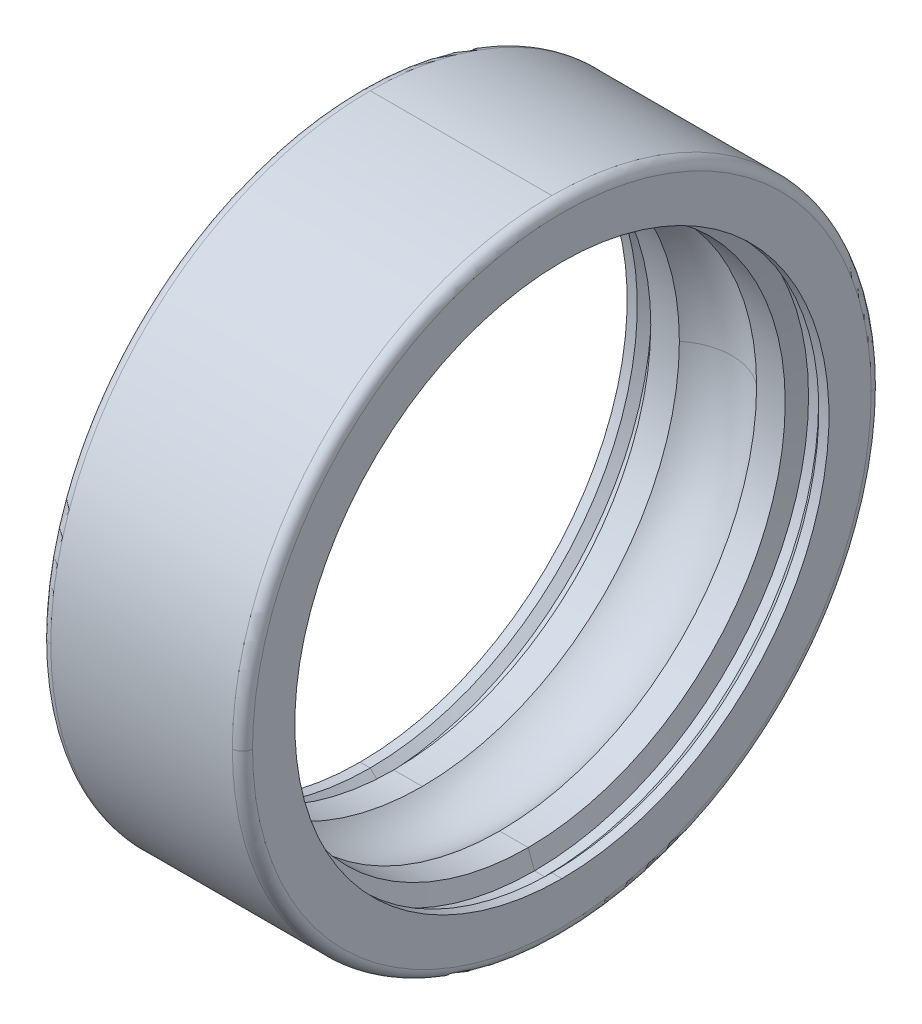
ISO-10303-21;
HEADER;
FILE_DESCRIPTION(('STEP AP214'),'2;1');
FILE_NAME('part.step','',(''),(''),'','','');
FILE_SCHEMA(('AUTOMOTIVE_DESIGN { 1 0 10303 214 1 1 1 1 }'));
ENDSEC;
DATA;
#1=APPLICATION_CONTEXT('core data for automotive mechanical design processes');
#2=APPLICATION_PROTOCOL_DEFINITION('international standard','automotive_design',2000,#1);
#3=PRODUCT_CONTEXT('',#1,'mechanical');
#4=PRODUCT('Part','Part','',(#3));
#5=PRODUCT_RELATED_PRODUCT_CATEGORY('part','',(#4));
#6=PRODUCT_DEFINITION_FORMATION('','',#4);
#7=PRODUCT_DEFINITION_CONTEXT('part definition',#1,'design');
#8=PRODUCT_DEFINITION('design','',#6,#7);
#9=PRODUCT_DEFINITION_SHAPE('','',#8);
#10=(LENGTH_UNIT() NAMED_UNIT(*) SI_UNIT(.MILLI.,.METRE.));
#11=(NAMED_UNIT(*) PLANE_ANGLE_UNIT() SI_UNIT($,.RADIAN.));
#12=(NAMED_UNIT(*) SI_UNIT($,.STERADIAN.) SOLID_ANGLE_UNIT());
#13=UNCERTAINTY_MEASURE_WITH_UNIT(LENGTH_MEASURE(1.E-05),#10,'distance_accuracy_value','');
#14=(GEOMETRIC_REPRESENTATION_CONTEXT(3) GLOBAL_UNCERTAINTY_ASSIGNED_CONTEXT((#13)) GLOBAL_UNIT_ASSIGNED_CONTEXT((#10,
#11,#12)) REPRESENTATION_CONTEXT('',''));
#15=CARTESIAN_POINT('',(0.,0.,0.));
#16=DIRECTION('',(0.,0.,1.));
#17=DIRECTION('',(1.,0.,0.));
#18=AXIS2_PLACEMENT_3D('',#15,#16,#17);
#19=CARTESIAN_POINT('',(0.,0.,0.));
#20=DIRECTION('',(1.,0.,0.));
#21=DIRECTION('',(0.,1.,0.));
#22=AXIS2_PLACEMENT_3D('',#19,#20,#21);
#23=CYLINDRICAL_SURFACE('',#22,9.5);
#24=DIRECTION('',(1.,0.,0.));
#25=VECTOR('',#24,1.);
#26=CARTESIAN_POINT('',(0.,-9.5,0.));
#27=LINE('',#26,#25);
#28=CARTESIAN_POINT('',(-2.7,-9.5,0.));
#29=VERTEX_POINT('',#28);
#30=CARTESIAN_POINT('',(2.7,-9.5,0.));
#31=VERTEX_POINT('',#30);
#32=EDGE_CURVE('E265',#29,#31,#27,.T.);
#33=ORIENTED_EDGE('',*,*,#32,.F.);
#34=CARTESIAN_POINT('',(-2.7,0.,0.));
#35=DIRECTION('',(1.,0.,0.));
#36=DIRECTION('',(0.,0.,-1.));
#37=AXIS2_PLACEMENT_3D('',#34,#35,#36);
#38=CIRCLE('',#37,9.5);
#39=CARTESIAN_POINT('',(-2.7,0.,-9.5));
#40=VERTEX_POINT('',#39);
#41=EDGE_CURVE('E42',#29,#40,#38,.T.);
#42=ORIENTED_EDGE('',*,*,#41,.T.);
#43=CARTESIAN_POINT('',(-2.7,0.,0.));
#44=DIRECTION('',(1.,0.,0.));
#45=DIRECTION('',(0.,0.,-1.));
#46=AXIS2_PLACEMENT_3D('',#43,#44,#45);
#47=CIRCLE('',#46,9.5);
#48=CARTESIAN_POINT('',(-2.7,9.5,0.));
#49=VERTEX_POINT('',#48);
#50=EDGE_CURVE('E249',#40,#49,#47,.T.);
#51=ORIENTED_EDGE('',*,*,#50,.T.);
#52=DIRECTION('',(1.,0.,0.));
#53=VECTOR('',#52,1.);
#54=CARTESIAN_POINT('',(0.,9.5,0.));
#55=LINE('',#54,#53);
#56=CARTESIAN_POINT('',(2.7,9.5,0.));
#57=VERTEX_POINT('',#56);
#58=EDGE_CURVE('E287',#49,#57,#55,.T.);
#59=ORIENTED_EDGE('',*,*,#58,.T.);
#60=CARTESIAN_POINT('',(2.7,0.,0.));
#61=DIRECTION('',(1.,0.,0.));
#62=DIRECTION('',(0.,0.,-1.));
#63=AXIS2_PLACEMENT_3D('',#60,#61,#62);
#64=CIRCLE('',#63,9.5);
#65=CARTESIAN_POINT('',(2.7,0.,-9.5));
#66=VERTEX_POINT('',#65);
#67=EDGE_CURVE('E300',#66,#57,#64,.T.);
#68=ORIENTED_EDGE('',*,*,#67,.F.);
#69=CARTESIAN_POINT('',(2.7,0.,0.));
#70=DIRECTION('',(1.,0.,0.));
#71=DIRECTION('',(0.,0.,-1.));
#72=AXIS2_PLACEMENT_3D('',#69,#70,#71);
#73=CIRCLE('',#72,9.5);
#74=EDGE_CURVE('E11',#31,#66,#73,.T.);
#75=ORIENTED_EDGE('',*,*,#74,.F.);
#76=EDGE_LOOP('',(#33,#42,#51,#59,#68,#75));
#77=FACE_BOUND('',#76,.T.);
#78=ADVANCED_FACE('F16',(#77),#23,.T.);
#79=CARTESIAN_POINT('',(2.7,0.,0.));
#80=DIRECTION('',(1.,0.,0.));
#81=DIRECTION('',(0.,0.,-1.));
#82=AXIS2_PLACEMENT_3D('',#79,#80,#81);
#83=TOROIDAL_SURFACE('',#82,9.2,0.3);
#84=CARTESIAN_POINT('',(2.7,0.,9.2));
#85=DIRECTION('',(0.,1.,0.));
#86=DIRECTION('',(0.,0.,1.));
#87=AXIS2_PLACEMENT_3D('',#84,#85,#86);
#88=CIRCLE('',#87,0.3);
#89=CARTESIAN_POINT('',(2.7,0.,9.5));
#90=VERTEX_POINT('',#89);
#91=CARTESIAN_POINT('',(3.,0.,9.2));
#92=VERTEX_POINT('',#91);
#93=EDGE_CURVE('E295',#90,#92,#88,.T.);
#94=ORIENTED_EDGE('',*,*,#93,.F.);
#95=CARTESIAN_POINT('',(2.7,0.,0.));
#96=DIRECTION('',(1.,0.,0.));
#97=DIRECTION('',(0.,0.,-1.));
#98=AXIS2_PLACEMENT_3D('',#95,#96,#97);
#99=CIRCLE('',#98,9.5);
#100=EDGE_CURVE('E261',#90,#31,#99,.T.);
#101=ORIENTED_EDGE('',*,*,#100,.T.);
#102=ORIENTED_EDGE('',*,*,#74,.T.);
#103=CARTESIAN_POINT('',(2.7,0.,-9.2));
#104=DIRECTION('',(0.,-1.,0.));
#105=DIRECTION('',(0.,0.,-1.));
#106=AXIS2_PLACEMENT_3D('',#103,#104,#105);
#107=CIRCLE('',#106,0.3);
#108=CARTESIAN_POINT('',(3.,0.,-9.2));
#109=VERTEX_POINT('',#108);
#110=EDGE_CURVE('E333',#66,#109,#107,.T.);
#111=ORIENTED_EDGE('',*,*,#110,.T.);
#112=CARTESIAN_POINT('',(3.,0.,0.));
#113=DIRECTION('',(1.,0.,0.));
#114=DIRECTION('',(0.,0.,-1.));
#115=AXIS2_PLACEMENT_3D('',#112,#113,#114);
#116=CIRCLE('',#115,9.2);
#117=EDGE_CURVE('E27',#92,#109,#116,.T.);
#118=ORIENTED_EDGE('',*,*,#117,.F.);
#119=EDGE_LOOP('',(#94,#101,#102,#111,#118));
#120=FACE_BOUND('',#119,.T.);
#121=ADVANCED_FACE('F774',(#120),#83,.T.);
#122=CARTESIAN_POINT('',(3.,7.94285714285714,0.));
#123=DIRECTION('',(1.,0.,0.));
#124=DIRECTION('',(0.,1.,0.));
#125=AXIS2_PLACEMENT_3D('',#122,#123,#124);
#126=PLANE('',#125);
#127=CARTESIAN_POINT('',(3.,0.,0.));
#128=DIRECTION('',(1.,0.,0.));
#129=DIRECTION('',(0.,0.,-1.));
#130=AXIS2_PLACEMENT_3D('',#127,#128,#129);
#131=CIRCLE('',#130,7.94285714285714);
#132=CARTESIAN_POINT('',(3.,7.94285714285714,0.));
#133=VERTEX_POINT('',#132);
#134=CARTESIAN_POINT('',(3.,-7.94285714285714,0.));
#135=VERTEX_POINT('',#134);
#136=EDGE_CURVE('E444',#133,#135,#131,.T.);
#137=ORIENTED_EDGE('',*,*,#136,.F.);
#138=CARTESIAN_POINT('',(3.,0.,0.));
#139=DIRECTION('',(1.,0.,0.));
#140=DIRECTION('',(0.,0.,-1.));
#141=AXIS2_PLACEMENT_3D('',#138,#139,#140);
#142=CIRCLE('',#141,7.94285714285714);
#143=EDGE_CURVE('E338',#135,#133,#142,.T.);
#144=ORIENTED_EDGE('',*,*,#143,.F.);
#145=EDGE_LOOP('',(#137,#144));
#146=FACE_BOUND('',#145,.T.);
#147=CARTESIAN_POINT('',(3.,0.,0.));
#148=DIRECTION('',(1.,0.,0.));
#149=DIRECTION('',(0.,0.,-1.));
#150=AXIS2_PLACEMENT_3D('',#147,#148,#149);
#151=CIRCLE('',#150,9.2);
#152=EDGE_CURVE('E299',#109,#92,#151,.T.);
#153=ORIENTED_EDGE('',*,*,#152,.T.);
#154=ORIENTED_EDGE('',*,*,#117,.T.);
#155=EDGE_LOOP('',(#153,#154));
#156=FACE_BOUND('',#155,.T.);
#157=ADVANCED_FACE('F473',(#146,#156),#126,.T.);
#158=CARTESIAN_POINT('',(2.85,0.,0.));
#159=DIRECTION('',(1.,0.,0.));
#160=DIRECTION('',(0.,1.,0.));
#161=AXIS2_PLACEMENT_3D('',#158,#159,#160);
#162=CYLINDRICAL_SURFACE('',#161,7.94285714285714);
#163=DIRECTION('',(1.,0.,0.));
#164=VECTOR('',#163,1.);
#165=CARTESIAN_POINT('',(2.85,-7.94285714285714,0.));
#166=LINE('',#165,#164);
#167=CARTESIAN_POINT('',(2.7,-7.94285714285714,0.));
#168=VERTEX_POINT('',#167);
#169=EDGE_CURVE('E343',#168,#135,#166,.T.);
#170=ORIENTED_EDGE('',*,*,#169,.F.);
#171=CARTESIAN_POINT('',(2.7,0.,0.));
#172=DIRECTION('',(1.,0.,0.));
#173=DIRECTION('',(0.,0.,-1.));
#174=AXIS2_PLACEMENT_3D('',#171,#172,#173);
#175=CIRCLE('',#174,7.94285714285714);
#176=CARTESIAN_POINT('',(2.7,7.94285714285714,0.));
#177=VERTEX_POINT('',#176);
#178=EDGE_CURVE('E371',#177,#168,#175,.T.);
#179=ORIENTED_EDGE('',*,*,#178,.F.);
#180=DIRECTION('',(1.,0.,0.));
#181=VECTOR('',#180,1.);
#182=CARTESIAN_POINT('',(2.85,7.94285714285714,0.));
#183=LINE('',#182,#181);
#184=EDGE_CURVE('E342',#177,#133,#183,.T.);
#185=ORIENTED_EDGE('',*,*,#184,.T.);
#186=ORIENTED_EDGE('',*,*,#136,.T.);
#187=EDGE_LOOP('',(#170,#179,#185,#186));
#188=FACE_BOUND('',#187,.T.);
#189=ADVANCED_FACE('F466',(#188),#162,.F.);
#190=CARTESIAN_POINT('',(2.5920990299492,0.,0.));
#191=DIRECTION('',(-1.,0.,0.));
#192=DIRECTION('',(0.,1.,0.));
#193=AXIS2_PLACEMENT_3D('',#190,#191,#192);
#194=CONICAL_SURFACE('',#193,8.04705589842599,0.767944870877518);
#195=DIRECTION('',(-0.719339800338642,-0.694658370459007,0.));
#196=VECTOR('',#195,1.);
#197=CARTESIAN_POINT('',(2.5920990299492,-8.04705589842599,0.));
#198=LINE('',#197,#196);
#199=CARTESIAN_POINT('',(2.48419805989841,-8.15125465399484,0.));
#200=VERTEX_POINT('',#199);
#201=EDGE_CURVE('E260',#168,#200,#198,.T.);
#202=ORIENTED_EDGE('',*,*,#201,.F.);
#203=CARTESIAN_POINT('',(2.7,0.,0.));
#204=DIRECTION('',(1.,0.,0.));
#205=DIRECTION('',(0.,0.,-1.));
#206=AXIS2_PLACEMENT_3D('',#203,#204,#205);
#207=CIRCLE('',#206,7.94285714285714);
#208=EDGE_CURVE('E337',#168,#177,#207,.T.);
#209=ORIENTED_EDGE('',*,*,#208,.T.);
#210=DIRECTION('',(-0.719339800338642,0.694658370459007,0.));
#211=VECTOR('',#210,1.);
#212=CARTESIAN_POINT('',(2.5920990299492,8.04705589842599,0.));
#213=LINE('',#212,#211);
#214=CARTESIAN_POINT('',(2.48419805989841,8.15125465399484,0.));
#215=VERTEX_POINT('',#214);
#216=EDGE_CURVE('E259',#177,#215,#213,.T.);
#217=ORIENTED_EDGE('',*,*,#216,.T.);
#218=CARTESIAN_POINT('',(2.48419805989841,0.,0.));
#219=DIRECTION('',(1.,0.,0.));
#220=DIRECTION('',(0.,0.,-1.));
#221=AXIS2_PLACEMENT_3D('',#218,#219,#220);
#222=CIRCLE('',#221,8.15125465399484);
#223=EDGE_CURVE('E304',#200,#215,#222,.T.);
#224=ORIENTED_EDGE('',*,*,#223,.F.);
#225=EDGE_LOOP('',(#202,#209,#217,#224));
#226=FACE_BOUND('',#225,.T.);
#227=ADVANCED_FACE('F492',(#226),#194,.F.);
#228=CARTESIAN_POINT('',(2.33419805989841,0.,0.));
#229=DIRECTION('',(1.,0.,0.));
#230=DIRECTION('',(0.,1.,0.));
#231=AXIS2_PLACEMENT_3D('',#228,#229,#230);
#232=CYLINDRICAL_SURFACE('',#231,8.15125465399484);
#233=DIRECTION('',(1.,0.,0.));
#234=VECTOR('',#233,1.);
#235=CARTESIAN_POINT('',(2.33419805989841,-8.15125465399484,0.));
#236=LINE('',#235,#234);
#237=CARTESIAN_POINT('',(2.18419805989841,-8.15125465399484,0.));
#238=VERTEX_POINT('',#237);
#239=EDGE_CURVE('E309',#238,#200,#236,.T.);
#240=ORIENTED_EDGE('',*,*,#239,.F.);
#241=CARTESIAN_POINT('',(2.18419805989841,0.,0.));
#242=DIRECTION('',(1.,0.,0.));
#243=DIRECTION('',(0.,0.,-1.));
#244=AXIS2_PLACEMENT_3D('',#241,#242,#243);
#245=CIRCLE('',#244,8.15125465399484);
#246=CARTESIAN_POINT('',(2.18419805989841,8.15125465399484,0.));
#247=VERTEX_POINT('',#246);
#248=EDGE_CURVE('E332',#247,#238,#245,.T.);
#249=ORIENTED_EDGE('',*,*,#248,.F.);
#250=DIRECTION('',(1.,0.,0.));
#251=VECTOR('',#250,1.);
#252=CARTESIAN_POINT('',(2.33419805989841,8.15125465399484,0.));
#253=LINE('',#252,#251);
#254=EDGE_CURVE('E308',#247,#215,#253,.T.);
#255=ORIENTED_EDGE('',*,*,#254,.T.);
#256=CARTESIAN_POINT('',(2.48419805989841,0.,0.));
#257=DIRECTION('',(1.,0.,0.));
#258=DIRECTION('',(0.,0.,-1.));
#259=AXIS2_PLACEMENT_3D('',#256,#257,#258);
#260=CIRCLE('',#259,8.15125465399484);
#261=EDGE_CURVE('E255',#215,#200,#260,.T.);
#262=ORIENTED_EDGE('',*,*,#261,.T.);
#263=EDGE_LOOP('',(#240,#249,#255,#262));
#264=FACE_BOUND('',#263,.T.);
#265=ADVANCED_FACE('F719',(#264),#232,.F.);
#266=CARTESIAN_POINT('',(2.09167727928384,0.,0.));
#267=DIRECTION('',(1.,0.,0.));
#268=DIRECTION('',(0.,1.,0.));
#269=AXIS2_PLACEMENT_3D('',#266,#267,#268);
#270=CONICAL_SURFACE('',#269,7.89705589842599,1.22173047639603);
#271=DIRECTION('',(0.342020143325669,-0.939692620785908,0.));
#272=VECTOR('',#271,1.);
#273=CARTESIAN_POINT('',(2.09167727928384,-7.89705589842599,0.));
#274=LINE('',#273,#272);
#275=CARTESIAN_POINT('',(1.99915649866927,-7.64285714285714,0.));
#276=VERTEX_POINT('',#275);
#277=EDGE_CURVE('E277',#276,#238,#274,.T.);
#278=ORIENTED_EDGE('',*,*,#277,.F.);
#279=CARTESIAN_POINT('',(1.99915649866927,0.,0.));
#280=DIRECTION('',(1.,0.,0.));
#281=DIRECTION('',(0.,0.,-1.));
#282=AXIS2_PLACEMENT_3D('',#279,#280,#281);
#283=CIRCLE('',#282,7.64285714285714);
#284=CARTESIAN_POINT('',(1.99915649866927,7.64285714285714,0.));
#285=VERTEX_POINT('',#284);
#286=EDGE_CURVE('E253',#285,#276,#283,.T.);
#287=ORIENTED_EDGE('',*,*,#286,.F.);
#288=DIRECTION('',(0.342020143325669,0.939692620785908,0.));
#289=VECTOR('',#288,1.);
#290=CARTESIAN_POINT('',(2.09167727928384,7.89705589842599,0.));
#291=LINE('',#290,#289);
#292=EDGE_CURVE('E272',#285,#247,#291,.T.);
#293=ORIENTED_EDGE('',*,*,#292,.T.);
#294=ORIENTED_EDGE('',*,*,#248,.T.);
#295=EDGE_LOOP('',(#278,#287,#293,#294));
#296=FACE_BOUND('',#295,.T.);
#297=ADVANCED_FACE('F715',(#296),#270,.F.);
#298=CARTESIAN_POINT('',(1.57403012803932,0.,0.));
#299=DIRECTION('',(1.,0.,0.));
#300=DIRECTION('',(0.,1.,0.));
#301=AXIS2_PLACEMENT_3D('',#298,#299,#300);
#302=CYLINDRICAL_SURFACE('',#301,7.64285714285714);
#303=DIRECTION('',(1.,0.,0.));
#304=VECTOR('',#303,1.);
#305=CARTESIAN_POINT('',(1.57403012803932,-7.64285714285714,0.));
#306=LINE('',#305,#304);
#307=CARTESIAN_POINT('',(1.14890375740937,-7.64285714285714,0.));
#308=VERTEX_POINT('',#307);
#309=EDGE_CURVE('E244',#308,#276,#306,.T.);
#310=ORIENTED_EDGE('',*,*,#309,.F.);
#311=CARTESIAN_POINT('',(1.14890375740937,0.,0.));
#312=DIRECTION('',(1.,0.,0.));
#313=DIRECTION('',(0.,0.,-1.));
#314=AXIS2_PLACEMENT_3D('',#311,#312,#313);
#315=CIRCLE('',#314,7.64285714285714);
#316=CARTESIAN_POINT('',(1.14890375740937,0.,7.64285714285714));
#317=VERTEX_POINT('',#316);
#318=EDGE_CURVE('E366',#317,#308,#315,.T.);
#319=ORIENTED_EDGE('',*,*,#318,.F.);
#320=CARTESIAN_POINT('',(1.14890375740937,0.,0.));
#321=DIRECTION('',(1.,0.,0.));
#322=DIRECTION('',(0.,0.,-1.));
#323=AXIS2_PLACEMENT_3D('',#320,#321,#322);
#324=CIRCLE('',#323,7.64285714285714);
#325=CARTESIAN_POINT('',(1.14890375740937,7.64285714285714,0.));
#326=VERTEX_POINT('',#325);
#327=EDGE_CURVE('E250',#326,#317,#324,.T.);
#328=ORIENTED_EDGE('',*,*,#327,.F.);
#329=DIRECTION('',(1.,0.,0.));
#330=VECTOR('',#329,1.);
#331=CARTESIAN_POINT('',(1.57403012803932,7.64285714285714,0.));
#332=LINE('',#331,#330);
#333=EDGE_CURVE('E280',#326,#285,#332,.T.);
#334=ORIENTED_EDGE('',*,*,#333,.T.);
#335=ORIENTED_EDGE('',*,*,#286,.T.);
#336=EDGE_LOOP('',(#310,#319,#328,#334,#335));
#337=FACE_BOUND('',#336,.T.);
#338=ADVANCED_FACE('F665',(#337),#302,.F.);
#339=CARTESIAN_POINT('',(0.,0.,0.));
#340=DIRECTION('',(1.,0.,0.));
#341=DIRECTION('',(0.,0.,-1.));
#342=AXIS2_PLACEMENT_3D('',#339,#340,#341);
#343=TOROIDAL_SURFACE('',#342,6.25,1.80555555555555);
#344=CARTESIAN_POINT('',(0.,0.,6.25));
#345=DIRECTION('',(0.,1.,0.));
#346=DIRECTION('',(0.,0.,1.));
#347=AXIS2_PLACEMENT_3D('',#344,#345,#346);
#348=CIRCLE('',#347,1.80555555555555);
#349=CARTESIAN_POINT('',(-1.14890375740937,0.,7.64285714285714));
#350=VERTEX_POINT('',#349);
#351=EDGE_CURVE('E414',#350,#317,#348,.T.);
#352=ORIENTED_EDGE('',*,*,#351,.F.);
#353=CARTESIAN_POINT('',(-1.14890375740937,0.,0.));
#354=DIRECTION('',(1.,0.,0.));
#355=DIRECTION('',(0.,0.,-1.));
#356=AXIS2_PLACEMENT_3D('',#353,#354,#355);
#357=CIRCLE('',#356,7.64285714285714);
#358=CARTESIAN_POINT('',(-1.14890375740937,7.64285714285714,0.));
#359=VERTEX_POINT('',#358);
#360=EDGE_CURVE('E254',#359,#350,#357,.T.);
#361=ORIENTED_EDGE('',*,*,#360,.F.);
#362=CARTESIAN_POINT('',(-1.14890375740937,0.,0.));
#363=DIRECTION('',(1.,0.,0.));
#364=DIRECTION('',(0.,0.,-1.));
#365=AXIS2_PLACEMENT_3D('',#362,#363,#364);
#366=CIRCLE('',#365,7.64285714285714);
#367=CARTESIAN_POINT('',(-1.14890375740937,0.,-7.64285714285714));
#368=VERTEX_POINT('',#367);
#369=EDGE_CURVE('E315',#368,#359,#366,.T.);
#370=ORIENTED_EDGE('',*,*,#369,.F.);
#371=CARTESIAN_POINT('',(0.,0.,-6.25));
#372=DIRECTION('',(0.,-1.,0.));
#373=DIRECTION('',(0.,0.,-1.));
#374=AXIS2_PLACEMENT_3D('',#371,#372,#373);
#375=CIRCLE('',#374,1.80555555555555);
#376=CARTESIAN_POINT('',(1.14890375740937,0.,-7.64285714285714));
#377=VERTEX_POINT('',#376);
#378=EDGE_CURVE('E362',#368,#377,#375,.T.);
#379=ORIENTED_EDGE('',*,*,#378,.T.);
#380=CARTESIAN_POINT('',(1.14890375740937,0.,0.));
#381=DIRECTION('',(1.,0.,0.));
#382=DIRECTION('',(0.,0.,-1.));
#383=AXIS2_PLACEMENT_3D('',#380,#381,#382);
#384=CIRCLE('',#383,7.64285714285714);
#385=EDGE_CURVE('E284',#377,#326,#384,.T.);
#386=ORIENTED_EDGE('',*,*,#385,.T.);
#387=ORIENTED_EDGE('',*,*,#327,.T.);
#388=EDGE_LOOP('',(#352,#361,#370,#379,#386,#387));
#389=FACE_BOUND('',#388,.T.);
#390=ADVANCED_FACE('F649',(#389),#343,.F.);
#391=CARTESIAN_POINT('',(-1.57403012803932,0.,0.));
#392=DIRECTION('',(1.,0.,0.));
#393=DIRECTION('',(0.,1.,0.));
#394=AXIS2_PLACEMENT_3D('',#391,#392,#393);
#395=CYLINDRICAL_SURFACE('',#394,7.64285714285714);
#396=DIRECTION('',(1.,0.,0.));
#397=VECTOR('',#396,1.);
#398=CARTESIAN_POINT('',(-1.57403012803932,-7.64285714285714,0.));
#399=LINE('',#398,#397);
#400=CARTESIAN_POINT('',(-1.99915649866927,-7.64285714285714,0.));
#401=VERTEX_POINT('',#400);
#402=CARTESIAN_POINT('',(-1.14890375740937,-7.64285714285714,0.));
#403=VERTEX_POINT('',#402);
#404=EDGE_CURVE('E421',#401,#403,#399,.T.);
#405=ORIENTED_EDGE('',*,*,#404,.F.);
#406=CARTESIAN_POINT('',(-1.99915649866927,0.,0.));
#407=DIRECTION('',(1.,0.,0.));
#408=DIRECTION('',(0.,0.,-1.));
#409=AXIS2_PLACEMENT_3D('',#406,#407,#408);
#410=CIRCLE('',#409,7.64285714285714);
#411=CARTESIAN_POINT('',(-1.99915649866927,7.64285714285714,0.));
#412=VERTEX_POINT('',#411);
#413=EDGE_CURVE('E314',#412,#401,#410,.T.);
#414=ORIENTED_EDGE('',*,*,#413,.F.);
#415=DIRECTION('',(1.,0.,0.));
#416=VECTOR('',#415,1.);
#417=CARTESIAN_POINT('',(-1.57403012803932,7.64285714285714,0.));
#418=LINE('',#417,#416);
#419=EDGE_CURVE('E310',#412,#359,#418,.T.);
#420=ORIENTED_EDGE('',*,*,#419,.T.);
#421=ORIENTED_EDGE('',*,*,#360,.T.);
#422=CARTESIAN_POINT('',(-1.14890375740937,0.,0.));
#423=DIRECTION('',(1.,0.,0.));
#424=DIRECTION('',(0.,0.,-1.));
#425=AXIS2_PLACEMENT_3D('',#422,#423,#424);
#426=CIRCLE('',#425,7.64285714285714);
#427=EDGE_CURVE('E20',#350,#403,#426,.T.);
#428=ORIENTED_EDGE('',*,*,#427,.T.);
#429=EDGE_LOOP('',(#405,#414,#420,#421,#428));
#430=FACE_BOUND('',#429,.T.);
#431=ADVANCED_FACE('F644',(#430),#395,.F.);
#432=CARTESIAN_POINT('',(-2.09167727928384,0.,0.));
#433=DIRECTION('',(-1.,0.,0.));
#434=DIRECTION('',(0.,1.,0.));
#435=AXIS2_PLACEMENT_3D('',#432,#433,#434);
#436=CONICAL_SURFACE('',#435,7.89705589842599,1.22173047639603);
#437=DIRECTION('',(-0.342020143325669,-0.939692620785908,0.));
#438=VECTOR('',#437,1.);
#439=CARTESIAN_POINT('',(-2.09167727928384,-7.89705589842599,0.));
#440=LINE('',#439,#438);
#441=CARTESIAN_POINT('',(-2.18419805989841,-8.15125465399484,0.));
#442=VERTEX_POINT('',#441);
#443=EDGE_CURVE('E387',#401,#442,#440,.T.);
#444=ORIENTED_EDGE('',*,*,#443,.F.);
#445=CARTESIAN_POINT('',(-1.99915649866927,0.,0.));
#446=DIRECTION('',(1.,0.,0.));
#447=DIRECTION('',(0.,0.,-1.));
#448=AXIS2_PLACEMENT_3D('',#445,#446,#447);
#449=CIRCLE('',#448,7.64285714285714);
#450=EDGE_CURVE('E376',#401,#412,#449,.T.);
#451=ORIENTED_EDGE('',*,*,#450,.T.);
#452=DIRECTION('',(-0.342020143325669,0.939692620785908,0.));
#453=VECTOR('',#452,1.);
#454=CARTESIAN_POINT('',(-2.09167727928384,7.89705589842599,0.));
#455=LINE('',#454,#453);
#456=CARTESIAN_POINT('',(-2.18419805989841,8.15125465399484,0.));
#457=VERTEX_POINT('',#456);
#458=EDGE_CURVE('E320',#412,#457,#455,.T.);
#459=ORIENTED_EDGE('',*,*,#458,.T.);
#460=CARTESIAN_POINT('',(-2.18419805989841,0.,0.));
#461=DIRECTION('',(1.,0.,0.));
#462=DIRECTION('',(0.,0.,-1.));
#463=AXIS2_PLACEMENT_3D('',#460,#461,#462);
#464=CIRCLE('',#463,8.15125465399484);
#465=EDGE_CURVE('E240',#442,#457,#464,.T.);
#466=ORIENTED_EDGE('',*,*,#465,.F.);
#467=EDGE_LOOP('',(#444,#451,#459,#466));
#468=FACE_BOUND('',#467,.T.);
#469=ADVANCED_FACE('F648',(#468),#436,.F.);
#470=CARTESIAN_POINT('',(-2.33419805989841,0.,0.));
#471=DIRECTION('',(1.,0.,0.));
#472=DIRECTION('',(0.,1.,0.));
#473=AXIS2_PLACEMENT_3D('',#470,#471,#472);
#474=CYLINDRICAL_SURFACE('',#473,8.15125465399484);
#475=DIRECTION('',(1.,0.,0.));
#476=VECTOR('',#475,1.);
#477=CARTESIAN_POINT('',(-2.33419805989841,-8.15125465399484,0.));
#478=LINE('',#477,#476);
#479=CARTESIAN_POINT('',(-2.48419805989841,-8.15125465399484,0.));
#480=VERTEX_POINT('',#479);
#481=EDGE_CURVE('E319',#480,#442,#478,.T.);
#482=ORIENTED_EDGE('',*,*,#481,.F.);
#483=CARTESIAN_POINT('',(-2.48419805989841,0.,0.));
#484=DIRECTION('',(1.,0.,0.));
#485=DIRECTION('',(0.,0.,-1.));
#486=AXIS2_PLACEMENT_3D('',#483,#484,#485);
#487=CIRCLE('',#486,8.15125465399484);
#488=CARTESIAN_POINT('',(-2.48419805989841,8.15125465399484,0.));
#489=VERTEX_POINT('',#488);
#490=EDGE_CURVE('E210',#489,#480,#487,.T.);
#491=ORIENTED_EDGE('',*,*,#490,.F.);
#492=DIRECTION('',(1.,0.,0.));
#493=VECTOR('',#492,1.);
#494=CARTESIAN_POINT('',(-2.33419805989841,8.15125465399484,0.));
#495=LINE('',#494,#493);
#496=EDGE_CURVE('E233',#489,#457,#495,.T.);
#497=ORIENTED_EDGE('',*,*,#496,.T.);
#498=CARTESIAN_POINT('',(-2.18419805989841,0.,0.));
#499=DIRECTION('',(1.,0.,0.));
#500=DIRECTION('',(0.,0.,-1.));
#501=AXIS2_PLACEMENT_3D('',#498,#499,#500);
#502=CIRCLE('',#501,8.15125465399484);
#503=EDGE_CURVE('E383',#457,#442,#502,.T.);
#504=ORIENTED_EDGE('',*,*,#503,.T.);
#505=EDGE_LOOP('',(#482,#491,#497,#504));
#506=FACE_BOUND('',#505,.T.);
#507=ADVANCED_FACE('F657',(#506),#474,.F.);
#508=CARTESIAN_POINT('',(-2.5920990299492,0.,0.));
#509=DIRECTION('',(1.,0.,0.));
#510=DIRECTION('',(0.,1.,0.));
#511=AXIS2_PLACEMENT_3D('',#508,#509,#510);
#512=CONICAL_SURFACE('',#511,8.04705589842599,0.767944870877516);
#513=DIRECTION('',(0.719339800338644,-0.694658370459005,0.));
#514=VECTOR('',#513,1.);
#515=CARTESIAN_POINT('',(-2.5920990299492,-8.04705589842599,0.));
#516=LINE('',#515,#514);
#517=CARTESIAN_POINT('',(-2.7,-7.94285714285714,0.));
#518=VERTEX_POINT('',#517);
#519=EDGE_CURVE('E223',#518,#480,#516,.T.);
#520=ORIENTED_EDGE('',*,*,#519,.F.);
#521=CARTESIAN_POINT('',(-2.7,0.,0.));
#522=DIRECTION('',(1.,0.,0.));
#523=DIRECTION('',(0.,0.,-1.));
#524=AXIS2_PLACEMENT_3D('',#521,#522,#523);
#525=CIRCLE('',#524,7.94285714285714);
#526=CARTESIAN_POINT('',(-2.7,7.94285714285714,0.));
#527=VERTEX_POINT('',#526);
#528=EDGE_CURVE('E193',#527,#518,#525,.T.);
#529=ORIENTED_EDGE('',*,*,#528,.F.);
#530=DIRECTION('',(0.719339800338644,0.694658370459005,0.));
#531=VECTOR('',#530,1.);
#532=CARTESIAN_POINT('',(-2.5920990299492,8.04705589842599,0.));
#533=LINE('',#532,#531);
#534=EDGE_CURVE('E229',#527,#489,#533,.T.);
#535=ORIENTED_EDGE('',*,*,#534,.T.);
#536=ORIENTED_EDGE('',*,*,#490,.T.);
#537=EDGE_LOOP('',(#520,#529,#535,#536));
#538=FACE_BOUND('',#537,.T.);
#539=ADVANCED_FACE('F224',(#538),#512,.F.);
#540=CARTESIAN_POINT('',(-2.85,0.,0.));
#541=DIRECTION('',(1.,0.,0.));
#542=DIRECTION('',(0.,1.,0.));
#543=AXIS2_PLACEMENT_3D('',#540,#541,#542);
#544=CYLINDRICAL_SURFACE('',#543,7.94285714285714);
#545=DIRECTION('',(1.,0.,0.));
#546=VECTOR('',#545,1.);
#547=CARTESIAN_POINT('',(-2.85,-7.94285714285714,0.));
#548=LINE('',#547,#546);
#549=CARTESIAN_POINT('',(-3.,-7.94285714285714,0.));
#550=VERTEX_POINT('',#549);
#551=EDGE_CURVE('E204',#550,#518,#548,.T.);
#552=ORIENTED_EDGE('',*,*,#551,.F.);
#553=CARTESIAN_POINT('',(-3.,0.,0.));
#554=DIRECTION('',(1.,0.,0.));
#555=DIRECTION('',(0.,0.,-1.));
#556=AXIS2_PLACEMENT_3D('',#553,#554,#555);
#557=CIRCLE('',#556,7.94285714285714);
#558=CARTESIAN_POINT('',(-3.,7.94285714285714,0.));
#559=VERTEX_POINT('',#558);
#560=EDGE_CURVE('E211',#559,#550,#557,.T.);
#561=ORIENTED_EDGE('',*,*,#560,.F.);
#562=DIRECTION('',(1.,0.,0.));
#563=VECTOR('',#562,1.);
#564=CARTESIAN_POINT('',(-2.85,7.94285714285714,0.));
#565=LINE('',#564,#563);
#566=EDGE_CURVE('E207',#559,#527,#565,.T.);
#567=ORIENTED_EDGE('',*,*,#566,.T.);
#568=ORIENTED_EDGE('',*,*,#528,.T.);
#569=EDGE_LOOP('',(#552,#561,#567,#568));
#570=FACE_BOUND('',#569,.T.);
#571=ADVANCED_FACE('F203',(#570),#544,.F.);
#572=CARTESIAN_POINT('',(-3.,9.20000000481501,0.));
#573=DIRECTION('',(-1.,0.,0.));
#574=DIRECTION('',(0.,0.,1.));
#575=AXIS2_PLACEMENT_3D('',#572,#573,#574);
#576=PLANE('',#575);
#577=ORIENTED_EDGE('',*,*,#560,.T.);
#578=CARTESIAN_POINT('',(-3.,0.,0.));
#579=DIRECTION('',(1.,0.,0.));
#580=DIRECTION('',(0.,0.,-1.));
#581=AXIS2_PLACEMENT_3D('',#578,#579,#580);
#582=CIRCLE('',#581,7.94285714285714);
#583=EDGE_CURVE('E219',#550,#559,#582,.T.);
#584=ORIENTED_EDGE('',*,*,#583,.T.);
#585=EDGE_LOOP('',(#577,#584));
#586=FACE_BOUND('',#585,.T.);
#587=CARTESIAN_POINT('',(-3.,0.,0.));
#588=DIRECTION('',(1.,0.,0.));
#589=DIRECTION('',(0.,0.,-1.));
#590=AXIS2_PLACEMENT_3D('',#587,#588,#589);
#591=CIRCLE('',#590,9.20000000481501);
#592=CARTESIAN_POINT('',(-3.,0.,-9.20000000481501));
#593=VERTEX_POINT('',#592);
#594=CARTESIAN_POINT('',(-3.,0.,9.20000000481501));
#595=VERTEX_POINT('',#594);
#596=EDGE_CURVE('E267',#593,#595,#591,.T.);
#597=ORIENTED_EDGE('',*,*,#596,.F.);
#598=CARTESIAN_POINT('',(-3.,0.,0.));
#599=DIRECTION('',(1.,0.,0.));
#600=DIRECTION('',(0.,0.,-1.));
#601=AXIS2_PLACEMENT_3D('',#598,#599,#600);
#602=CIRCLE('',#601,9.20000000481501);
#603=EDGE_CURVE('E248',#595,#593,#602,.T.);
#604=ORIENTED_EDGE('',*,*,#603,.F.);
#605=EDGE_LOOP('',(#597,#604));
#606=FACE_BOUND('',#605,.T.);
#607=ADVANCED_FACE('F687',(#586,#606),#576,.T.);
#608=CARTESIAN_POINT('',(-2.7,0.,0.));
#609=DIRECTION('',(1.,0.,0.));
#610=DIRECTION('',(0.,0.,-1.));
#611=AXIS2_PLACEMENT_3D('',#608,#609,#610);
#612=TOROIDAL_SURFACE('',#611,9.2,0.3);
#613=CARTESIAN_POINT('',(-2.7,0.,9.2));
#614=DIRECTION('',(0.,1.,0.));
#615=DIRECTION('',(0.,0.,1.));
#616=AXIS2_PLACEMENT_3D('',#613,#614,#615);
#617=CIRCLE('',#616,0.3);
#618=CARTESIAN_POINT('',(-2.7,0.,9.5));
#619=VERTEX_POINT('',#618);
#620=EDGE_CURVE('E271',#595,#619,#617,.T.);
#621=ORIENTED_EDGE('',*,*,#620,.F.);
#622=ORIENTED_EDGE('',*,*,#603,.T.);
#623=CARTESIAN_POINT('',(-2.7,0.,-9.2));
#624=DIRECTION('',(0.,-1.,0.));
#625=DIRECTION('',(0.,0.,-1.));
#626=AXIS2_PLACEMENT_3D('',#623,#624,#625);
#627=CIRCLE('',#626,0.3);
#628=EDGE_CURVE('E246',#593,#40,#627,.T.);
#629=ORIENTED_EDGE('',*,*,#628,.T.);
#630=ORIENTED_EDGE('',*,*,#41,.F.);
#631=CARTESIAN_POINT('',(-2.7,0.,0.));
#632=DIRECTION('',(1.,0.,0.));
#633=DIRECTION('',(0.,0.,-1.));
#634=AXIS2_PLACEMENT_3D('',#631,#632,#633);
#635=CIRCLE('',#634,9.5);
#636=EDGE_CURVE('E380',#619,#29,#635,.T.);
#637=ORIENTED_EDGE('',*,*,#636,.F.);
#638=EDGE_LOOP('',(#621,#622,#629,#630,#637));
#639=FACE_BOUND('',#638,.T.);
#640=ADVANCED_FACE('F691',(#639),#612,.T.);
#641=CARTESIAN_POINT('',(-2.7,0.,0.));
#642=DIRECTION('',(1.,0.,0.));
#643=DIRECTION('',(0.,0.,-1.));
#644=AXIS2_PLACEMENT_3D('',#641,#642,#643);
#645=TOROIDAL_SURFACE('',#644,9.2,0.3);
#646=ORIENTED_EDGE('',*,*,#596,.T.);
#647=ORIENTED_EDGE('',*,*,#620,.T.);
#648=CARTESIAN_POINT('',(-2.7,0.,0.));
#649=DIRECTION('',(1.,0.,0.));
#650=DIRECTION('',(0.,0.,-1.));
#651=AXIS2_PLACEMENT_3D('',#648,#649,#650);
#652=CIRCLE('',#651,9.5);
#653=EDGE_CURVE('E291',#49,#619,#652,.T.);
#654=ORIENTED_EDGE('',*,*,#653,.F.);
#655=ORIENTED_EDGE('',*,*,#50,.F.);
#656=ORIENTED_EDGE('',*,*,#628,.F.);
#657=EDGE_LOOP('',(#646,#647,#654,#655,#656));
#658=FACE_BOUND('',#657,.T.);
#659=ADVANCED_FACE('F769',(#658),#645,.T.);
#660=CARTESIAN_POINT('',(-2.85,0.,0.));
#661=DIRECTION('',(1.,0.,0.));
#662=DIRECTION('',(0.,1.,0.));
#663=AXIS2_PLACEMENT_3D('',#660,#661,#662);
#664=CYLINDRICAL_SURFACE('',#663,7.94285714285714);
#665=ORIENTED_EDGE('',*,*,#583,.F.);
#666=ORIENTED_EDGE('',*,*,#551,.T.);
#667=CARTESIAN_POINT('',(-2.7,0.,0.));
#668=DIRECTION('',(1.,0.,0.));
#669=DIRECTION('',(0.,0.,-1.));
#670=AXIS2_PLACEMENT_3D('',#667,#668,#669);
#671=CIRCLE('',#670,7.94285714285714);
#672=EDGE_CURVE('E217',#518,#527,#671,.T.);
#673=ORIENTED_EDGE('',*,*,#672,.T.);
#674=ORIENTED_EDGE('',*,*,#566,.F.);
#675=EDGE_LOOP('',(#665,#666,#673,#674));
#676=FACE_BOUND('',#675,.T.);
#677=ADVANCED_FACE('F215',(#676),#664,.F.);
#678=CARTESIAN_POINT('',(-2.5920990299492,0.,0.));
#679=DIRECTION('',(1.,0.,0.));
#680=DIRECTION('',(0.,1.,0.));
#681=AXIS2_PLACEMENT_3D('',#678,#679,#680);
#682=CONICAL_SURFACE('',#681,8.04705589842599,0.767944870877516);
#683=ORIENTED_EDGE('',*,*,#672,.F.);
#684=ORIENTED_EDGE('',*,*,#519,.T.);
#685=CARTESIAN_POINT('',(-2.48419805989841,0.,0.));
#686=DIRECTION('',(1.,0.,0.));
#687=DIRECTION('',(0.,0.,-1.));
#688=AXIS2_PLACEMENT_3D('',#685,#686,#687);
#689=CIRCLE('',#688,8.15125465399484);
#690=EDGE_CURVE('E316',#480,#489,#689,.T.);
#691=ORIENTED_EDGE('',*,*,#690,.T.);
#692=ORIENTED_EDGE('',*,*,#534,.F.);
#693=EDGE_LOOP('',(#683,#684,#691,#692));
#694=FACE_BOUND('',#693,.T.);
#695=ADVANCED_FACE('F231',(#694),#682,.F.);
#696=CARTESIAN_POINT('',(-2.33419805989841,0.,0.));
#697=DIRECTION('',(1.,0.,0.));
#698=DIRECTION('',(0.,1.,0.));
#699=AXIS2_PLACEMENT_3D('',#696,#697,#698);
#700=CYLINDRICAL_SURFACE('',#699,8.15125465399484);
#701=ORIENTED_EDGE('',*,*,#690,.F.);
#702=ORIENTED_EDGE('',*,*,#481,.T.);
#703=ORIENTED_EDGE('',*,*,#465,.T.);
#704=ORIENTED_EDGE('',*,*,#496,.F.);
#705=EDGE_LOOP('',(#701,#702,#703,#704));
#706=FACE_BOUND('',#705,.T.);
#707=ADVANCED_FACE('F682',(#706),#700,.F.);
#708=CARTESIAN_POINT('',(-2.09167727928384,0.,0.));
#709=DIRECTION('',(-1.,0.,0.));
#710=DIRECTION('',(0.,1.,0.));
#711=AXIS2_PLACEMENT_3D('',#708,#709,#710);
#712=CONICAL_SURFACE('',#711,7.89705589842599,1.22173047639603);
#713=ORIENTED_EDGE('',*,*,#413,.T.);
#714=ORIENTED_EDGE('',*,*,#443,.T.);
#715=ORIENTED_EDGE('',*,*,#503,.F.);
#716=ORIENTED_EDGE('',*,*,#458,.F.);
#717=EDGE_LOOP('',(#713,#714,#715,#716));
#718=FACE_BOUND('',#717,.T.);
#719=ADVANCED_FACE('F854',(#718),#712,.F.);
#720=CARTESIAN_POINT('',(-1.57403012803932,0.,0.));
#721=DIRECTION('',(1.,0.,0.));
#722=DIRECTION('',(0.,1.,0.));
#723=AXIS2_PLACEMENT_3D('',#720,#721,#722);
#724=CYLINDRICAL_SURFACE('',#723,7.64285714285714);
#725=ORIENTED_EDGE('',*,*,#450,.F.);
#726=ORIENTED_EDGE('',*,*,#404,.T.);
#727=CARTESIAN_POINT('',(-1.14890375740937,0.,0.));
#728=DIRECTION('',(1.,0.,0.));
#729=DIRECTION('',(0.,0.,-1.));
#730=AXIS2_PLACEMENT_3D('',#727,#728,#729);
#731=CIRCLE('',#730,7.64285714285714);
#732=EDGE_CURVE('E365',#403,#368,#731,.T.);
#733=ORIENTED_EDGE('',*,*,#732,.T.);
#734=ORIENTED_EDGE('',*,*,#369,.T.);
#735=ORIENTED_EDGE('',*,*,#419,.F.);
#736=EDGE_LOOP('',(#725,#726,#733,#734,#735));
#737=FACE_BOUND('',#736,.T.);
#738=ADVANCED_FACE('F735',(#737),#724,.F.);
#739=CARTESIAN_POINT('',(0.,0.,0.));
#740=DIRECTION('',(1.,0.,0.));
#741=DIRECTION('',(0.,0.,-1.));
#742=AXIS2_PLACEMENT_3D('',#739,#740,#741);
#743=TOROIDAL_SURFACE('',#742,6.25,1.80555555555555);
#744=ORIENTED_EDGE('',*,*,#427,.F.);
#745=ORIENTED_EDGE('',*,*,#351,.T.);
#746=ORIENTED_EDGE('',*,*,#318,.T.);
#747=CARTESIAN_POINT('',(1.14890375740937,0.,0.));
#748=DIRECTION('',(1.,0.,0.));
#749=DIRECTION('',(0.,0.,-1.));
#750=AXIS2_PLACEMENT_3D('',#747,#748,#749);
#751=CIRCLE('',#750,7.64285714285714);
#752=EDGE_CURVE('E276',#308,#377,#751,.T.);
#753=ORIENTED_EDGE('',*,*,#752,.T.);
#754=ORIENTED_EDGE('',*,*,#378,.F.);
#755=ORIENTED_EDGE('',*,*,#732,.F.);
#756=EDGE_LOOP('',(#744,#745,#746,#753,#754,#755));
#757=FACE_BOUND('',#756,.T.);
#758=ADVANCED_FACE('F639',(#757),#743,.F.);
#759=CARTESIAN_POINT('',(1.57403012803932,0.,0.));
#760=DIRECTION('',(1.,0.,0.));
#761=DIRECTION('',(0.,1.,0.));
#762=AXIS2_PLACEMENT_3D('',#759,#760,#761);
#763=CYLINDRICAL_SURFACE('',#762,7.64285714285714);
#764=ORIENTED_EDGE('',*,*,#752,.F.);
#765=ORIENTED_EDGE('',*,*,#309,.T.);
#766=CARTESIAN_POINT('',(1.99915649866927,0.,0.));
#767=DIRECTION('',(1.,0.,0.));
#768=DIRECTION('',(0.,0.,-1.));
#769=AXIS2_PLACEMENT_3D('',#766,#767,#768);
#770=CIRCLE('',#769,7.64285714285714);
#771=EDGE_CURVE('E347',#276,#285,#770,.T.);
#772=ORIENTED_EDGE('',*,*,#771,.T.);
#773=ORIENTED_EDGE('',*,*,#333,.F.);
#774=ORIENTED_EDGE('',*,*,#385,.F.);
#775=EDGE_LOOP('',(#764,#765,#772,#773,#774));
#776=FACE_BOUND('',#775,.T.);
#777=ADVANCED_FACE('F18',(#776),#763,.F.);
#778=CARTESIAN_POINT('',(2.09167727928384,0.,0.));
#779=DIRECTION('',(1.,0.,0.));
#780=DIRECTION('',(0.,1.,0.));
#781=AXIS2_PLACEMENT_3D('',#778,#779,#780);
#782=CONICAL_SURFACE('',#781,7.89705589842599,1.22173047639603);
#783=ORIENTED_EDGE('',*,*,#771,.F.);
#784=ORIENTED_EDGE('',*,*,#277,.T.);
#785=CARTESIAN_POINT('',(2.18419805989841,0.,0.));
#786=DIRECTION('',(1.,0.,0.));
#787=DIRECTION('',(0.,0.,-1.));
#788=AXIS2_PLACEMENT_3D('',#785,#786,#787);
#789=CIRCLE('',#788,8.15125465399484);
#790=EDGE_CURVE('E326',#238,#247,#789,.T.);
#791=ORIENTED_EDGE('',*,*,#790,.T.);
#792=ORIENTED_EDGE('',*,*,#292,.F.);
#793=EDGE_LOOP('',(#783,#784,#791,#792));
#794=FACE_BOUND('',#793,.T.);
#795=ADVANCED_FACE('F638',(#794),#782,.F.);
#796=CARTESIAN_POINT('',(2.33419805989841,0.,0.));
#797=DIRECTION('',(1.,0.,0.));
#798=DIRECTION('',(0.,1.,0.));
#799=AXIS2_PLACEMENT_3D('',#796,#797,#798);
#800=CYLINDRICAL_SURFACE('',#799,8.15125465399484);
#801=ORIENTED_EDGE('',*,*,#790,.F.);
#802=ORIENTED_EDGE('',*,*,#239,.T.);
#803=ORIENTED_EDGE('',*,*,#223,.T.);
#804=ORIENTED_EDGE('',*,*,#254,.F.);
#805=EDGE_LOOP('',(#801,#802,#803,#804));
#806=FACE_BOUND('',#805,.T.);
#807=ADVANCED_FACE('F709',(#806),#800,.F.);
#808=CARTESIAN_POINT('',(2.5920990299492,0.,0.));
#809=DIRECTION('',(-1.,0.,0.));
#810=DIRECTION('',(0.,1.,0.));
#811=AXIS2_PLACEMENT_3D('',#808,#809,#810);
#812=CONICAL_SURFACE('',#811,8.04705589842599,0.767944870877518);
#813=ORIENTED_EDGE('',*,*,#178,.T.);
#814=ORIENTED_EDGE('',*,*,#201,.T.);
#815=ORIENTED_EDGE('',*,*,#261,.F.);
#816=ORIENTED_EDGE('',*,*,#216,.F.);
#817=EDGE_LOOP('',(#813,#814,#815,#816));
#818=FACE_BOUND('',#817,.T.);
#819=ADVANCED_FACE('F701',(#818),#812,.F.);
#820=CARTESIAN_POINT('',(2.85,0.,0.));
#821=DIRECTION('',(1.,0.,0.));
#822=DIRECTION('',(0.,1.,0.));
#823=AXIS2_PLACEMENT_3D('',#820,#821,#822);
#824=CYLINDRICAL_SURFACE('',#823,7.94285714285714);
#825=ORIENTED_EDGE('',*,*,#208,.F.);
#826=ORIENTED_EDGE('',*,*,#169,.T.);
#827=ORIENTED_EDGE('',*,*,#143,.T.);
#828=ORIENTED_EDGE('',*,*,#184,.F.);
#829=EDGE_LOOP('',(#825,#826,#827,#828));
#830=FACE_BOUND('',#829,.T.);
#831=ADVANCED_FACE('F471',(#830),#824,.F.);
#832=CARTESIAN_POINT('',(2.7,0.,0.));
#833=DIRECTION('',(1.,0.,0.));
#834=DIRECTION('',(0.,0.,-1.));
#835=AXIS2_PLACEMENT_3D('',#832,#833,#834);
#836=TOROIDAL_SURFACE('',#835,9.2,0.3);
#837=ORIENTED_EDGE('',*,*,#67,.T.);
#838=CARTESIAN_POINT('',(2.7,0.,0.));
#839=DIRECTION('',(1.,0.,0.));
#840=DIRECTION('',(0.,0.,-1.));
#841=AXIS2_PLACEMENT_3D('',#838,#839,#840);
#842=CIRCLE('',#841,9.5);
#843=EDGE_CURVE('E264',#57,#90,#842,.T.);
#844=ORIENTED_EDGE('',*,*,#843,.T.);
#845=ORIENTED_EDGE('',*,*,#93,.T.);
#846=ORIENTED_EDGE('',*,*,#152,.F.);
#847=ORIENTED_EDGE('',*,*,#110,.F.);
#848=EDGE_LOOP('',(#837,#844,#845,#846,#847));
#849=FACE_BOUND('',#848,.T.);
#850=ADVANCED_FACE('F700',(#849),#836,.T.);
#851=CARTESIAN_POINT('',(0.,0.,0.));
#852=DIRECTION('',(1.,0.,0.));
#853=DIRECTION('',(0.,1.,0.));
#854=AXIS2_PLACEMENT_3D('',#851,#852,#853);
#855=CYLINDRICAL_SURFACE('',#854,9.5);
#856=ORIENTED_EDGE('',*,*,#636,.T.);
#857=ORIENTED_EDGE('',*,*,#32,.T.);
#858=ORIENTED_EDGE('',*,*,#100,.F.);
#859=ORIENTED_EDGE('',*,*,#843,.F.);
#860=ORIENTED_EDGE('',*,*,#58,.F.);
#861=ORIENTED_EDGE('',*,*,#653,.T.);
#862=EDGE_LOOP('',(#856,#857,#858,#859,#860,#861));
#863=FACE_BOUND('',#862,.T.);
#864=ADVANCED_FACE('F757',(#863),#855,.T.);
#865=CLOSED_SHELL('',(#78,#121,#157,#189,#227,#265,#297,#338,#390,#431,#469,#507,#539,#571,#607,
#640,#659,#677,#695,#707,#719,#738,#758,#777,#795,#807,#819,#831,#850,#864));
#866=MANIFOLD_SOLID_BREP('B1',#865);
#867=ADVANCED_BREP_SHAPE_REPRESENTATION('',(#18,#866),#14);
#868=SHAPE_DEFINITION_REPRESENTATION(#9,#867);
ENDSEC;
END-ISO-10303-21;
